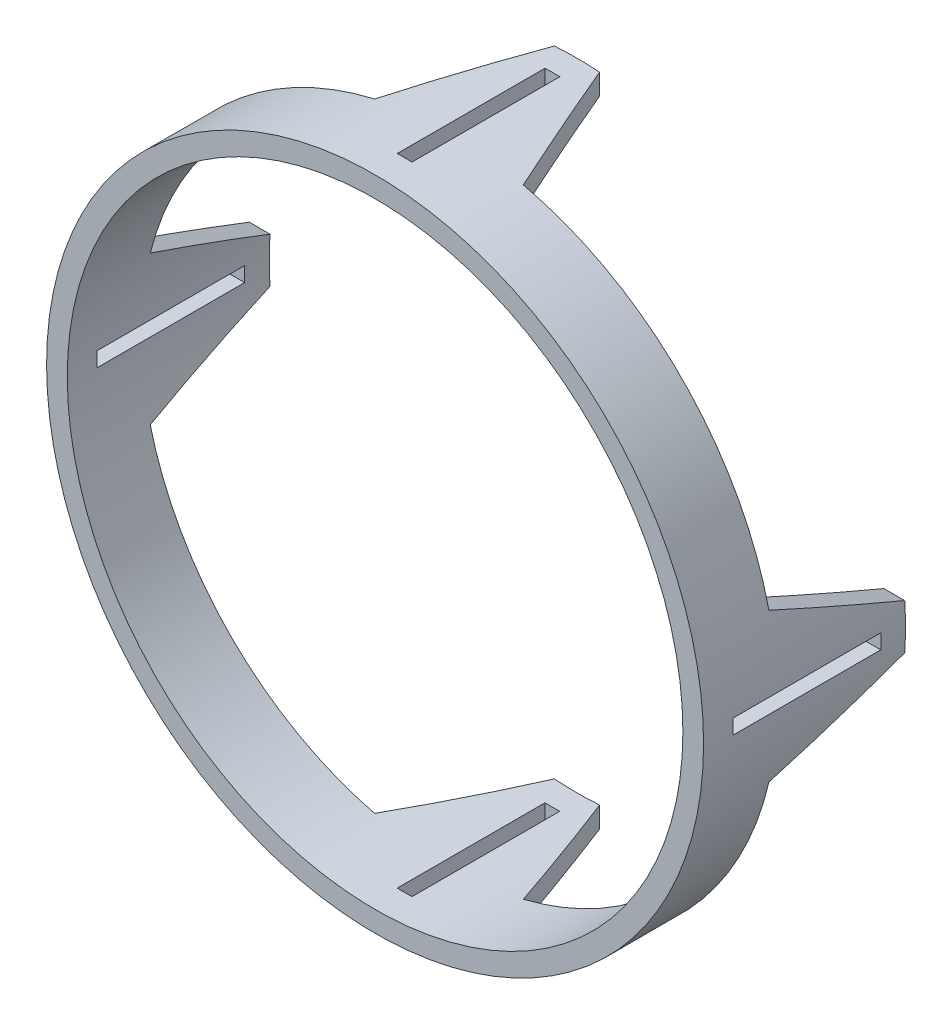
ISO-10303-21;
HEADER;
FILE_DESCRIPTION(('STEP AP214'),'2;1');
FILE_NAME('part.step','',(''),(''),'','','');
FILE_SCHEMA(('AUTOMOTIVE_DESIGN { 1 0 10303 214 1 1 1 1 }'));
ENDSEC;
DATA;
#1=APPLICATION_CONTEXT('core data for automotive mechanical design processes');
#2=APPLICATION_PROTOCOL_DEFINITION('international standard','automotive_design',2000,#1);
#3=PRODUCT_CONTEXT('',#1,'mechanical');
#4=PRODUCT('Part','Part','',(#3));
#5=PRODUCT_RELATED_PRODUCT_CATEGORY('part','',(#4));
#6=PRODUCT_DEFINITION_FORMATION('','',#4);
#7=PRODUCT_DEFINITION_CONTEXT('part definition',#1,'design');
#8=PRODUCT_DEFINITION('design','',#6,#7);
#9=PRODUCT_DEFINITION_SHAPE('','',#8);
#10=(LENGTH_UNIT() NAMED_UNIT(*) SI_UNIT(.MILLI.,.METRE.));
#11=(NAMED_UNIT(*) PLANE_ANGLE_UNIT() SI_UNIT($,.RADIAN.));
#12=(NAMED_UNIT(*) SI_UNIT($,.STERADIAN.) SOLID_ANGLE_UNIT());
#13=UNCERTAINTY_MEASURE_WITH_UNIT(LENGTH_MEASURE(1.E-05),#10,'distance_accuracy_value','');
#14=(GEOMETRIC_REPRESENTATION_CONTEXT(3) GLOBAL_UNCERTAINTY_ASSIGNED_CONTEXT((#13)) GLOBAL_UNIT_ASSIGNED_CONTEXT((#10,
#11,#12)) REPRESENTATION_CONTEXT('',''));
#15=CARTESIAN_POINT('',(0.,0.,0.));
#16=DIRECTION('',(0.,0.,1.));
#17=DIRECTION('',(1.,0.,0.));
#18=AXIS2_PLACEMENT_3D('',#15,#16,#17);
#19=CARTESIAN_POINT('',(0.,0.,0.));
#20=DIRECTION('',(0.,0.,1.));
#21=DIRECTION('',(1.,0.,0.));
#22=AXIS2_PLACEMENT_3D('',#19,#20,#21);
#23=PLANE('',#22);
#24=CARTESIAN_POINT('',(0.,0.,0.));
#25=DIRECTION('',(0.,0.,1.));
#26=DIRECTION('',(1.,0.,0.));
#27=AXIS2_PLACEMENT_3D('',#24,#25,#26);
#28=CIRCLE('',#27,79.375);
#29=CARTESIAN_POINT('',(77.0235892178491,19.1770000000011,0.));
#30=VERTEX_POINT('',#29);
#31=CARTESIAN_POINT('',(19.1770000000002,77.0235892178493,0.));
#32=VERTEX_POINT('',#31);
#33=EDGE_CURVE('E460',#30,#32,#28,.T.);
#34=ORIENTED_EDGE('',*,*,#33,.T.);
#35=DIRECTION('',(0.,1.,0.));
#36=VECTOR('',#35,1.);
#37=CARTESIAN_POINT('',(19.1770000000002,84.5159952671682,0.));
#38=LINE('',#37,#36);
#39=CARTESIAN_POINT('',(19.1770000000002,82.5097409522051,0.));
#40=VERTEX_POINT('',#39);
#41=EDGE_CURVE('E346',#32,#40,#38,.T.);
#42=ORIENTED_EDGE('',*,*,#41,.T.);
#43=CARTESIAN_POINT('',(0.,0.,0.));
#44=DIRECTION('',(0.,0.,1.));
#45=DIRECTION('',(1.,0.,0.));
#46=AXIS2_PLACEMENT_3D('',#43,#44,#45);
#47=CIRCLE('',#46,84.709);
#48=CARTESIAN_POINT('',(82.5097409522049,19.1770000000011,0.));
#49=VERTEX_POINT('',#48);
#50=EDGE_CURVE('E444',#49,#40,#47,.T.);
#51=ORIENTED_EDGE('',*,*,#50,.F.);
#52=DIRECTION('',(-1.,0.,0.));
#53=VECTOR('',#52,1.);
#54=CARTESIAN_POINT('',(79.1689926675839,19.1770000000011,0.));
#55=LINE('',#54,#53);
#56=EDGE_CURVE('E342',#49,#30,#55,.T.);
#57=ORIENTED_EDGE('',*,*,#56,.T.);
#58=EDGE_LOOP('',(#34,#42,#51,#57));
#59=FACE_BOUND('',#58,.T.);
#60=ADVANCED_FACE('F41',(#59),#23,.F.);
#61=CARTESIAN_POINT('',(19.1770000000002,-82.5097409522051,0.));
#62=VERTEX_POINT('',#61);
#63=CARTESIAN_POINT('',(82.5097409522053,-19.1769999999993,0.));
#64=VERTEX_POINT('',#63);
#65=EDGE_CURVE('E453',#62,#64,#47,.T.);
#66=ORIENTED_EDGE('',*,*,#65,.F.);
#67=DIRECTION('',(0.,1.,0.));
#68=VECTOR('',#67,1.);
#69=CARTESIAN_POINT('',(19.1770000000002,-79.1689926675842,0.));
#70=LINE('',#69,#68);
#71=CARTESIAN_POINT('',(19.1770000000002,-77.0235892178493,0.));
#72=VERTEX_POINT('',#71);
#73=EDGE_CURVE('E362',#62,#72,#70,.T.);
#74=ORIENTED_EDGE('',*,*,#73,.T.);
#75=CARTESIAN_POINT('',(77.0235892178495,-19.1769999999994,0.));
#76=VERTEX_POINT('',#75);
#77=EDGE_CURVE('E463',#72,#76,#28,.T.);
#78=ORIENTED_EDGE('',*,*,#77,.T.);
#79=DIRECTION('',(1.,0.,0.));
#80=VECTOR('',#79,1.);
#81=CARTESIAN_POINT('',(84.5159952671685,-19.1769999999993,0.));
#82=LINE('',#81,#80);
#83=EDGE_CURVE('E358',#76,#64,#82,.T.);
#84=ORIENTED_EDGE('',*,*,#83,.T.);
#85=EDGE_LOOP('',(#66,#74,#78,#84));
#86=FACE_BOUND('',#85,.T.);
#87=ADVANCED_FACE('F591',(#86),#23,.F.);
#88=CARTESIAN_POINT('',(-77.0235892178495,-19.1769999999994,0.));
#89=VERTEX_POINT('',#88);
#90=CARTESIAN_POINT('',(-19.1770000000003,-77.0235892178493,0.));
#91=VERTEX_POINT('',#90);
#92=EDGE_CURVE('E467',#89,#91,#28,.T.);
#93=ORIENTED_EDGE('',*,*,#92,.T.);
#94=DIRECTION('',(0.,-1.,0.));
#95=VECTOR('',#94,1.);
#96=CARTESIAN_POINT('',(-19.1770000000003,-84.5159952671682,0.));
#97=LINE('',#96,#95);
#98=CARTESIAN_POINT('',(-19.1770000000003,-82.5097409522051,0.));
#99=VERTEX_POINT('',#98);
#100=EDGE_CURVE('E354',#91,#99,#97,.T.);
#101=ORIENTED_EDGE('',*,*,#100,.T.);
#102=CARTESIAN_POINT('',(-82.5097409522053,-19.1769999999993,0.));
#103=VERTEX_POINT('',#102);
#104=EDGE_CURVE('E457',#103,#99,#47,.T.);
#105=ORIENTED_EDGE('',*,*,#104,.F.);
#106=DIRECTION('',(1.,0.,0.));
#107=VECTOR('',#106,1.);
#108=CARTESIAN_POINT('',(-79.1689926675844,-19.1769999999994,0.));
#109=LINE('',#108,#107);
#110=EDGE_CURVE('E350',#103,#89,#109,.T.);
#111=ORIENTED_EDGE('',*,*,#110,.T.);
#112=EDGE_LOOP('',(#93,#101,#105,#111));
#113=FACE_BOUND('',#112,.T.);
#114=ADVANCED_FACE('F482',(#113),#23,.F.);
#115=CARTESIAN_POINT('',(-19.1770000000002,77.0235892178493,0.));
#116=VERTEX_POINT('',#115);
#117=CARTESIAN_POINT('',(-77.0235892178491,19.1770000000011,0.));
#118=VERTEX_POINT('',#117);
#119=EDGE_CURVE('E466',#116,#118,#28,.T.);
#120=ORIENTED_EDGE('',*,*,#119,.T.);
#121=DIRECTION('',(-1.,0.,0.));
#122=VECTOR('',#121,1.);
#123=CARTESIAN_POINT('',(-84.515995267168,19.1770000000012,0.));
#124=LINE('',#123,#122);
#125=CARTESIAN_POINT('',(-82.5097409522049,19.1770000000011,0.));
#126=VERTEX_POINT('',#125);
#127=EDGE_CURVE('E338',#118,#126,#124,.T.);
#128=ORIENTED_EDGE('',*,*,#127,.T.);
#129=CARTESIAN_POINT('',(-19.1770000000002,82.5097409522051,0.));
#130=VERTEX_POINT('',#129);
#131=EDGE_CURVE('E456',#130,#126,#47,.T.);
#132=ORIENTED_EDGE('',*,*,#131,.F.);
#133=DIRECTION('',(0.,-1.,0.));
#134=VECTOR('',#133,1.);
#135=CARTESIAN_POINT('',(-19.1770000000002,79.1689926675842,0.));
#136=LINE('',#135,#134);
#137=EDGE_CURVE('E334',#130,#116,#136,.T.);
#138=ORIENTED_EDGE('',*,*,#137,.T.);
#139=EDGE_LOOP('',(#120,#128,#132,#138));
#140=FACE_BOUND('',#139,.T.);
#141=ADVANCED_FACE('F577',(#140),#23,.F.);
#142=CARTESIAN_POINT('',(0.,0.,19.05));
#143=DIRECTION('',(0.,0.,1.));
#144=DIRECTION('',(1.,0.,0.));
#145=AXIS2_PLACEMENT_3D('',#142,#143,#144);
#146=PLANE('',#145);
#147=CARTESIAN_POINT('',(0.,0.,19.05));
#148=DIRECTION('',(0.,0.,1.));
#149=DIRECTION('',(1.,0.,0.));
#150=AXIS2_PLACEMENT_3D('',#147,#148,#149);
#151=CIRCLE('',#150,84.709);
#152=CARTESIAN_POINT('',(84.709,0.,19.05));
#153=VERTEX_POINT('',#152);
#154=EDGE_CURVE('E496',#153,#153,#151,.T.);
#155=ORIENTED_EDGE('',*,*,#154,.T.);
#156=EDGE_LOOP('',(#155));
#157=FACE_BOUND('',#156,.T.);
#158=CARTESIAN_POINT('',(0.,0.,19.05));
#159=DIRECTION('',(0.,0.,1.));
#160=DIRECTION('',(1.,0.,0.));
#161=AXIS2_PLACEMENT_3D('',#158,#159,#160);
#162=CIRCLE('',#161,79.375);
#163=CARTESIAN_POINT('',(79.375,0.,19.05));
#164=VERTEX_POINT('',#163);
#165=EDGE_CURVE('E454',#164,#164,#162,.T.);
#166=ORIENTED_EDGE('',*,*,#165,.F.);
#167=EDGE_LOOP('',(#166));
#168=FACE_BOUND('',#167,.T.);
#169=ADVANCED_FACE('F575',(#157,#168),#146,.T.);
#170=CARTESIAN_POINT('',(0.,0.,19.05));
#171=DIRECTION('',(0.,0.,-1.));
#172=DIRECTION('',(-1.,0.,0.));
#173=AXIS2_PLACEMENT_3D('',#170,#171,#172);
#174=CYLINDRICAL_SURFACE('',#173,84.709);
#175=DIRECTION('',(0.,0.,-1.));
#176=VECTOR('',#175,1.);
#177=CARTESIAN_POINT('',(84.6875767512567,1.90500000000029,19.05));
#178=LINE('',#177,#176);
#179=CARTESIAN_POINT('',(84.6875767512567,1.90500000000029,11.43));
#180=VERTEX_POINT('',#179);
#181=CARTESIAN_POINT('',(84.6875767512567,1.90500000000029,-26.67));
#182=VERTEX_POINT('',#181);
#183=EDGE_CURVE('E542',#180,#182,#178,.T.);
#184=ORIENTED_EDGE('',*,*,#183,.T.);
#185=CARTESIAN_POINT('',(0.,0.,-26.67));
#186=DIRECTION('',(0.,0.,-1.));
#187=DIRECTION('',(-1.,0.,0.));
#188=AXIS2_PLACEMENT_3D('',#185,#186,#187);
#189=CIRCLE('',#188,84.709);
#190=CARTESIAN_POINT('',(84.6875767512567,-1.90499999999971,-26.67));
#191=VERTEX_POINT('',#190);
#192=EDGE_CURVE('E724',#182,#191,#189,.T.);
#193=ORIENTED_EDGE('',*,*,#192,.T.);
#194=DIRECTION('',(0.,0.,-1.));
#195=VECTOR('',#194,1.);
#196=CARTESIAN_POINT('',(84.6875767512567,-1.90499999999971,19.05));
#197=LINE('',#196,#195);
#198=CARTESIAN_POINT('',(84.6875767512567,-1.90499999999971,11.43));
#199=VERTEX_POINT('',#198);
#200=EDGE_CURVE('E725',#191,#199,#197,.F.);
#201=ORIENTED_EDGE('',*,*,#200,.T.);
#202=CARTESIAN_POINT('',(0.,0.,11.43));
#203=DIRECTION('',(0.,0.,1.));
#204=DIRECTION('',(1.,0.,0.));
#205=AXIS2_PLACEMENT_3D('',#202,#203,#204);
#206=CIRCLE('',#205,84.709);
#207=EDGE_CURVE('E733',#199,#180,#206,.T.);
#208=ORIENTED_EDGE('',*,*,#207,.T.);
#209=EDGE_LOOP('',(#184,#193,#201,#208));
#210=FACE_BOUND('',#209,.T.);
#211=DIRECTION('',(0.,0.,-1.));
#212=VECTOR('',#211,1.);
#213=CARTESIAN_POINT('',(1.905,84.6875767512567,19.05));
#214=LINE('',#213,#212);
#215=CARTESIAN_POINT('',(1.905,84.6875767512567,-26.67));
#216=VERTEX_POINT('',#215);
#217=CARTESIAN_POINT('',(1.905,84.6875767512567,11.43));
#218=VERTEX_POINT('',#217);
#219=EDGE_CURVE('E714',#216,#218,#214,.F.);
#220=ORIENTED_EDGE('',*,*,#219,.T.);
#221=CARTESIAN_POINT('',(-1.905,84.6875767512567,11.43));
#222=VERTEX_POINT('',#221);
#223=EDGE_CURVE('E736',#218,#222,#206,.T.);
#224=ORIENTED_EDGE('',*,*,#223,.T.);
#225=DIRECTION('',(0.,0.,-1.));
#226=VECTOR('',#225,1.);
#227=CARTESIAN_POINT('',(-1.905,84.6875767512567,19.05));
#228=LINE('',#227,#226);
#229=CARTESIAN_POINT('',(-1.905,84.6875767512567,-26.67));
#230=VERTEX_POINT('',#229);
#231=EDGE_CURVE('E718',#222,#230,#228,.T.);
#232=ORIENTED_EDGE('',*,*,#231,.T.);
#233=EDGE_CURVE('E686',#230,#216,#189,.T.);
#234=ORIENTED_EDGE('',*,*,#233,.T.);
#235=EDGE_LOOP('',(#220,#224,#232,#234));
#236=FACE_BOUND('',#235,.T.);
#237=CARTESIAN_POINT('',(-84.6875767512567,-1.9050000000003,-26.67));
#238=VERTEX_POINT('',#237);
#239=CARTESIAN_POINT('',(-84.6875767512567,1.90499999999911,-26.67));
#240=VERTEX_POINT('',#239);
#241=EDGE_CURVE('E721',#238,#240,#189,.T.);
#242=ORIENTED_EDGE('',*,*,#241,.T.);
#243=DIRECTION('',(0.,0.,-1.));
#244=VECTOR('',#243,1.);
#245=CARTESIAN_POINT('',(-84.6875767512567,1.90499999999911,19.05));
#246=LINE('',#245,#244);
#247=CARTESIAN_POINT('',(-84.6875767512567,1.90499999999911,11.43));
#248=VERTEX_POINT('',#247);
#249=EDGE_CURVE('E699',#240,#248,#246,.F.);
#250=ORIENTED_EDGE('',*,*,#249,.T.);
#251=CARTESIAN_POINT('',(-84.6875767512567,-1.9050000000003,11.43));
#252=VERTEX_POINT('',#251);
#253=EDGE_CURVE('E278',#248,#252,#206,.T.);
#254=ORIENTED_EDGE('',*,*,#253,.T.);
#255=DIRECTION('',(0.,0.,-1.));
#256=VECTOR('',#255,1.);
#257=CARTESIAN_POINT('',(-84.6875767512567,-1.9050000000003,19.05));
#258=LINE('',#257,#256);
#259=EDGE_CURVE('E729',#252,#238,#258,.T.);
#260=ORIENTED_EDGE('',*,*,#259,.T.);
#261=EDGE_LOOP('',(#242,#250,#254,#260));
#262=FACE_BOUND('',#261,.T.);
#263=DIRECTION('',(0.,0.,-1.));
#264=VECTOR('',#263,1.);
#265=CARTESIAN_POINT('',(1.905,-84.6875767512567,19.05));
#266=LINE('',#265,#264);
#267=CARTESIAN_POINT('',(1.905,-84.6875767512567,11.43));
#268=VERTEX_POINT('',#267);
#269=CARTESIAN_POINT('',(1.905,-84.6875767512567,-26.67));
#270=VERTEX_POINT('',#269);
#271=EDGE_CURVE('E554',#268,#270,#266,.T.);
#272=ORIENTED_EDGE('',*,*,#271,.T.);
#273=CARTESIAN_POINT('',(0.,0.,-26.67));
#274=DIRECTION('',(0.,0.,-1.));
#275=DIRECTION('',(-1.,0.,0.));
#276=AXIS2_PLACEMENT_3D('',#273,#274,#275);
#277=CIRCLE('',#276,84.709);
#278=CARTESIAN_POINT('',(-1.905,-84.6875767512567,-26.67));
#279=VERTEX_POINT('',#278);
#280=EDGE_CURVE('E546',#270,#279,#277,.T.);
#281=ORIENTED_EDGE('',*,*,#280,.T.);
#282=DIRECTION('',(0.,0.,-1.));
#283=VECTOR('',#282,1.);
#284=CARTESIAN_POINT('',(-1.905,-84.6875767512567,19.05));
#285=LINE('',#284,#283);
#286=CARTESIAN_POINT('',(-1.905,-84.6875767512567,11.43));
#287=VERTEX_POINT('',#286);
#288=EDGE_CURVE('E535',#279,#287,#285,.F.);
#289=ORIENTED_EDGE('',*,*,#288,.T.);
#290=CARTESIAN_POINT('',(0.,0.,11.43));
#291=DIRECTION('',(0.,0.,1.));
#292=DIRECTION('',(1.,0.,0.));
#293=AXIS2_PLACEMENT_3D('',#290,#291,#292);
#294=CIRCLE('',#293,84.709);
#295=EDGE_CURVE('E551',#287,#268,#294,.T.);
#296=ORIENTED_EDGE('',*,*,#295,.T.);
#297=EDGE_LOOP('',(#272,#281,#289,#296));
#298=FACE_BOUND('',#297,.T.);
#299=ORIENTED_EDGE('',*,*,#154,.F.);
#300=EDGE_LOOP('',(#299));
#301=FACE_BOUND('',#300,.T.);
#302=CARTESIAN_POINT('',(0.,0.,-33.02));
#303=DIRECTION('',(0.,0.,-1.));
#304=DIRECTION('',(-1.,0.,0.));
#305=AXIS2_PLACEMENT_3D('',#302,#303,#304);
#306=CIRCLE('',#305,84.709);
#307=CARTESIAN_POINT('',(-5.83605402292349,84.5077224544687,-33.02));
#308=VERTEX_POINT('',#307);
#309=CARTESIAN_POINT('',(5.83605402292349,84.5077224544687,-33.02));
#310=VERTEX_POINT('',#309);
#311=EDGE_CURVE('E464',#308,#310,#306,.T.);
#312=ORIENTED_EDGE('',*,*,#311,.F.);
#313=CARTESIAN_POINT('',(0.,0.,-47.4647405879654));
#314=DIRECTION('',(-0.927183854566789,0.,-0.374606593415909));
#315=DIRECTION('',(0.374606593415909,0.,-0.927183854566789));
#316=AXIS2_PLACEMENT_3D('',#313,#314,#315);
#317=ELLIPSE('',#316,226.12789387279,84.709);
#318=EDGE_CURVE('E379',#308,#130,#317,.F.);
#319=ORIENTED_EDGE('',*,*,#318,.T.);
#320=ORIENTED_EDGE('',*,*,#131,.T.);
#321=CARTESIAN_POINT('',(0.,0.,-47.4647405879649));
#322=DIRECTION('',(0.,0.927183854566789,-0.374606593415909));
#323=DIRECTION('',(0.,-0.374606593415909,-0.927183854566789));
#324=AXIS2_PLACEMENT_3D('',#321,#322,#323);
#325=ELLIPSE('',#324,226.12789387279,84.709);
#326=CARTESIAN_POINT('',(-84.5077224544686,5.83605402292442,-33.02));
#327=VERTEX_POINT('',#326);
#328=EDGE_CURVE('E372',#126,#327,#325,.F.);
#329=ORIENTED_EDGE('',*,*,#328,.T.);
#330=CARTESIAN_POINT('',(0.,0.,-33.02));
#331=DIRECTION('',(0.,0.,-1.));
#332=DIRECTION('',(-1.,0.,0.));
#333=AXIS2_PLACEMENT_3D('',#330,#331,#332);
#334=CIRCLE('',#333,84.709);
#335=CARTESIAN_POINT('',(-84.5077224544688,-5.83605402292257,-33.02));
#336=VERTEX_POINT('',#335);
#337=EDGE_CURVE('E103',#336,#327,#334,.T.);
#338=ORIENTED_EDGE('',*,*,#337,.F.);
#339=CARTESIAN_POINT('',(0.,0.,-47.4647405879664));
#340=DIRECTION('',(0.,-0.927183854566789,-0.374606593415909));
#341=DIRECTION('',(0.,0.374606593415909,-0.927183854566789));
#342=AXIS2_PLACEMENT_3D('',#339,#340,#341);
#343=ELLIPSE('',#342,226.12789387279,84.709);
#344=EDGE_CURVE('E422',#336,#103,#343,.F.);
#345=ORIENTED_EDGE('',*,*,#344,.T.);
#346=ORIENTED_EDGE('',*,*,#104,.T.);
#347=CARTESIAN_POINT('',(0.,0.,-47.4647405879654));
#348=DIRECTION('',(-0.927183854566789,0.,-0.374606593415909));
#349=DIRECTION('',(0.374606593415909,0.,-0.927183854566789));
#350=AXIS2_PLACEMENT_3D('',#347,#348,#349);
#351=ELLIPSE('',#350,226.12789387279,84.709);
#352=CARTESIAN_POINT('',(-5.83605402292351,-84.5077224544687,-33.02));
#353=VERTEX_POINT('',#352);
#354=EDGE_CURVE('E404',#99,#353,#351,.F.);
#355=ORIENTED_EDGE('',*,*,#354,.T.);
#356=CARTESIAN_POINT('',(0.,0.,-33.02));
#357=DIRECTION('',(0.,0.,-1.));
#358=DIRECTION('',(1.,0.,0.));
#359=AXIS2_PLACEMENT_3D('',#356,#357,#358);
#360=CIRCLE('',#359,84.709);
#361=CARTESIAN_POINT('',(5.83605402292347,-84.5077224544687,-33.02));
#362=VERTEX_POINT('',#361);
#363=EDGE_CURVE('E490',#362,#353,#360,.T.);
#364=ORIENTED_EDGE('',*,*,#363,.F.);
#365=CARTESIAN_POINT('',(0.,0.,-47.4647405879654));
#366=DIRECTION('',(0.927183854566789,0.,-0.374606593415909));
#367=DIRECTION('',(-0.374606593415909,0.,-0.927183854566789));
#368=AXIS2_PLACEMENT_3D('',#365,#366,#367);
#369=ELLIPSE('',#368,226.12789387279,84.709);
#370=EDGE_CURVE('E412',#362,#62,#369,.F.);
#371=ORIENTED_EDGE('',*,*,#370,.T.);
#372=ORIENTED_EDGE('',*,*,#65,.T.);
#373=CARTESIAN_POINT('',(0.,0.,-47.4647405879664));
#374=DIRECTION('',(0.,-0.927183854566789,-0.374606593415909));
#375=DIRECTION('',(0.,0.374606593415909,-0.927183854566789));
#376=AXIS2_PLACEMENT_3D('',#373,#374,#375);
#377=ELLIPSE('',#376,226.12789387279,84.709);
#378=CARTESIAN_POINT('',(84.5077224544688,-5.83605402292257,-33.02));
#379=VERTEX_POINT('',#378);
#380=EDGE_CURVE('E434',#64,#379,#377,.F.);
#381=ORIENTED_EDGE('',*,*,#380,.T.);
#382=CARTESIAN_POINT('',(0.,0.,-33.02));
#383=DIRECTION('',(0.,0.,-1.));
#384=DIRECTION('',(1.,0.,0.));
#385=AXIS2_PLACEMENT_3D('',#382,#383,#384);
#386=CIRCLE('',#385,84.709);
#387=CARTESIAN_POINT('',(84.5077224544686,5.83605402292442,-33.02));
#388=VERTEX_POINT('',#387);
#389=EDGE_CURVE('E66',#388,#379,#386,.T.);
#390=ORIENTED_EDGE('',*,*,#389,.F.);
#391=CARTESIAN_POINT('',(0.,0.,-47.4647405879649));
#392=DIRECTION('',(0.,0.927183854566789,-0.374606593415909));
#393=DIRECTION('',(0.,-0.374606593415909,-0.927183854566789));
#394=AXIS2_PLACEMENT_3D('',#391,#392,#393);
#395=ELLIPSE('',#394,226.12789387279,84.709);
#396=EDGE_CURVE('E51',#388,#49,#395,.F.);
#397=ORIENTED_EDGE('',*,*,#396,.T.);
#398=ORIENTED_EDGE('',*,*,#50,.T.);
#399=CARTESIAN_POINT('',(0.,0.,-47.4647405879654));
#400=DIRECTION('',(0.927183854566789,0.,-0.374606593415909));
#401=DIRECTION('',(-0.374606593415909,0.,-0.927183854566789));
#402=AXIS2_PLACEMENT_3D('',#399,#400,#401);
#403=ELLIPSE('',#402,226.12789387279,84.709);
#404=EDGE_CURVE('E393',#40,#310,#403,.F.);
#405=ORIENTED_EDGE('',*,*,#404,.T.);
#406=EDGE_LOOP('',(#312,#319,#320,#329,#338,#345,#346,#355,#364,#371,#372,#381,#390,#397,#398,#405));
#407=FACE_BOUND('',#406,.T.);
#408=ADVANCED_FACE('F443',(#210,#236,#262,#298,#301,#407),#174,.T.);
#409=CARTESIAN_POINT('',(0.,0.,19.05));
#410=DIRECTION('',(0.,0.,-1.));
#411=DIRECTION('',(-1.,0.,0.));
#412=AXIS2_PLACEMENT_3D('',#409,#410,#411);
#413=CYLINDRICAL_SURFACE('',#412,79.375);
#414=DIRECTION('',(0.,0.,-1.));
#415=VECTOR('',#414,1.);
#416=CARTESIAN_POINT('',(79.3521367072116,1.90500000000028,19.05));
#417=LINE('',#416,#415);
#418=CARTESIAN_POINT('',(79.3521367072116,1.90500000000028,11.43));
#419=VERTEX_POINT('',#418);
#420=CARTESIAN_POINT('',(79.3521367072116,1.90500000000028,-26.67));
#421=VERTEX_POINT('',#420);
#422=EDGE_CURVE('E298',#419,#421,#417,.T.);
#423=ORIENTED_EDGE('',*,*,#422,.F.);
#424=CARTESIAN_POINT('',(0.,0.,11.43));
#425=DIRECTION('',(0.,0.,1.));
#426=DIRECTION('',(1.,0.,0.));
#427=AXIS2_PLACEMENT_3D('',#424,#425,#426);
#428=CIRCLE('',#427,79.375);
#429=CARTESIAN_POINT('',(79.3521367072116,-1.90499999999972,11.43));
#430=VERTEX_POINT('',#429);
#431=EDGE_CURVE('E290',#430,#419,#428,.T.);
#432=ORIENTED_EDGE('',*,*,#431,.F.);
#433=DIRECTION('',(0.,0.,-1.));
#434=VECTOR('',#433,1.);
#435=CARTESIAN_POINT('',(79.3521367072116,-1.90499999999972,19.05));
#436=LINE('',#435,#434);
#437=CARTESIAN_POINT('',(79.3521367072116,-1.90499999999972,-26.67));
#438=VERTEX_POINT('',#437);
#439=EDGE_CURVE('E299',#438,#430,#436,.F.);
#440=ORIENTED_EDGE('',*,*,#439,.F.);
#441=CARTESIAN_POINT('',(0.,0.,-26.67));
#442=DIRECTION('',(0.,0.,-1.));
#443=DIRECTION('',(-1.,0.,0.));
#444=AXIS2_PLACEMENT_3D('',#441,#442,#443);
#445=CIRCLE('',#444,79.375);
#446=EDGE_CURVE('E309',#421,#438,#445,.T.);
#447=ORIENTED_EDGE('',*,*,#446,.F.);
#448=EDGE_LOOP('',(#423,#432,#440,#447));
#449=FACE_BOUND('',#448,.T.);
#450=DIRECTION('',(0.,0.,-1.));
#451=VECTOR('',#450,1.);
#452=CARTESIAN_POINT('',(-1.905,79.3521367072116,19.05));
#453=LINE('',#452,#451);
#454=CARTESIAN_POINT('',(-1.905,79.3521367072116,11.43));
#455=VERTEX_POINT('',#454);
#456=CARTESIAN_POINT('',(-1.905,79.3521367072116,-26.67));
#457=VERTEX_POINT('',#456);
#458=EDGE_CURVE('E301',#455,#457,#453,.T.);
#459=ORIENTED_EDGE('',*,*,#458,.F.);
#460=CARTESIAN_POINT('',(1.905,79.3521367072116,11.43));
#461=VERTEX_POINT('',#460);
#462=EDGE_CURVE('E291',#461,#455,#428,.T.);
#463=ORIENTED_EDGE('',*,*,#462,.F.);
#464=DIRECTION('',(0.,0.,-1.));
#465=VECTOR('',#464,1.);
#466=CARTESIAN_POINT('',(1.905,79.3521367072116,19.05));
#467=LINE('',#466,#465);
#468=CARTESIAN_POINT('',(1.905,79.3521367072116,-26.67));
#469=VERTEX_POINT('',#468);
#470=EDGE_CURVE('E288',#469,#461,#467,.F.);
#471=ORIENTED_EDGE('',*,*,#470,.F.);
#472=EDGE_CURVE('E294',#457,#469,#445,.T.);
#473=ORIENTED_EDGE('',*,*,#472,.F.);
#474=EDGE_LOOP('',(#459,#463,#471,#473));
#475=FACE_BOUND('',#474,.T.);
#476=CARTESIAN_POINT('',(-79.3521367072116,1.90499999999917,11.43));
#477=VERTEX_POINT('',#476);
#478=CARTESIAN_POINT('',(-79.3521367072116,-1.90500000000028,11.43));
#479=VERTEX_POINT('',#478);
#480=EDGE_CURVE('E276',#477,#479,#428,.T.);
#481=ORIENTED_EDGE('',*,*,#480,.F.);
#482=DIRECTION('',(0.,0.,-1.));
#483=VECTOR('',#482,1.);
#484=CARTESIAN_POINT('',(-79.3521367072116,1.90499999999917,19.05));
#485=LINE('',#484,#483);
#486=CARTESIAN_POINT('',(-79.3521367072116,1.90499999999917,-26.67));
#487=VERTEX_POINT('',#486);
#488=EDGE_CURVE('E257',#487,#477,#485,.F.);
#489=ORIENTED_EDGE('',*,*,#488,.F.);
#490=CARTESIAN_POINT('',(-79.3521367072116,-1.90500000000028,-26.67));
#491=VERTEX_POINT('',#490);
#492=EDGE_CURVE('E270',#491,#487,#445,.T.);
#493=ORIENTED_EDGE('',*,*,#492,.F.);
#494=DIRECTION('',(0.,0.,-1.));
#495=VECTOR('',#494,1.);
#496=CARTESIAN_POINT('',(-79.3521367072116,-1.90500000000028,19.05));
#497=LINE('',#496,#495);
#498=EDGE_CURVE('E286',#479,#491,#497,.T.);
#499=ORIENTED_EDGE('',*,*,#498,.F.);
#500=EDGE_LOOP('',(#481,#489,#493,#499));
#501=FACE_BOUND('',#500,.T.);
#502=DIRECTION('',(0.,0.,-1.));
#503=VECTOR('',#502,1.);
#504=CARTESIAN_POINT('',(1.905,-79.3521367072116,19.05));
#505=LINE('',#504,#503);
#506=CARTESIAN_POINT('',(1.905,-79.3521367072116,11.43));
#507=VERTEX_POINT('',#506);
#508=CARTESIAN_POINT('',(1.905,-79.3521367072116,-26.67));
#509=VERTEX_POINT('',#508);
#510=EDGE_CURVE('E271',#507,#509,#505,.T.);
#511=ORIENTED_EDGE('',*,*,#510,.F.);
#512=CARTESIAN_POINT('',(0.,0.,11.43));
#513=DIRECTION('',(0.,0.,1.));
#514=DIRECTION('',(1.,0.,0.));
#515=AXIS2_PLACEMENT_3D('',#512,#513,#514);
#516=CIRCLE('',#515,79.375);
#517=CARTESIAN_POINT('',(-1.905,-79.3521367072116,11.43));
#518=VERTEX_POINT('',#517);
#519=EDGE_CURVE('E505',#518,#507,#516,.T.);
#520=ORIENTED_EDGE('',*,*,#519,.F.);
#521=DIRECTION('',(0.,0.,-1.));
#522=VECTOR('',#521,1.);
#523=CARTESIAN_POINT('',(-1.905,-79.3521367072116,19.05));
#524=LINE('',#523,#522);
#525=CARTESIAN_POINT('',(-1.905,-79.3521367072116,-26.67));
#526=VERTEX_POINT('',#525);
#527=EDGE_CURVE('E502',#526,#518,#524,.F.);
#528=ORIENTED_EDGE('',*,*,#527,.F.);
#529=CARTESIAN_POINT('',(0.,0.,-26.67));
#530=DIRECTION('',(0.,0.,-1.));
#531=DIRECTION('',(-1.,0.,0.));
#532=AXIS2_PLACEMENT_3D('',#529,#530,#531);
#533=CIRCLE('',#532,79.375);
#534=EDGE_CURVE('E499',#509,#526,#533,.T.);
#535=ORIENTED_EDGE('',*,*,#534,.F.);
#536=EDGE_LOOP('',(#511,#520,#528,#535));
#537=FACE_BOUND('',#536,.T.);
#538=ORIENTED_EDGE('',*,*,#165,.T.);
#539=EDGE_LOOP('',(#538));
#540=FACE_BOUND('',#539,.T.);
#541=ORIENTED_EDGE('',*,*,#119,.F.);
#542=CARTESIAN_POINT('',(0.,0.,-47.4647405879654));
#543=DIRECTION('',(-0.927183854566789,0.,-0.374606593415909));
#544=DIRECTION('',(0.374606593415909,0.,-0.927183854566789));
#545=AXIS2_PLACEMENT_3D('',#542,#543,#544);
#546=ELLIPSE('',#545,211.888956027727,79.375);
#547=CARTESIAN_POINT('',(-5.83605402292349,79.1601610561873,-33.02));
#548=VERTEX_POINT('',#547);
#549=EDGE_CURVE('E382',#116,#548,#546,.T.);
#550=ORIENTED_EDGE('',*,*,#549,.T.);
#551=CARTESIAN_POINT('',(0.,0.,-33.02));
#552=DIRECTION('',(0.,0.,1.));
#553=DIRECTION('',(-1.,0.,0.));
#554=AXIS2_PLACEMENT_3D('',#551,#552,#553);
#555=CIRCLE('',#554,79.375);
#556=CARTESIAN_POINT('',(5.83605402292349,79.1601610561873,-33.02));
#557=VERTEX_POINT('',#556);
#558=EDGE_CURVE('E471',#557,#548,#555,.T.);
#559=ORIENTED_EDGE('',*,*,#558,.F.);
#560=CARTESIAN_POINT('',(0.,0.,-47.4647405879654));
#561=DIRECTION('',(0.927183854566789,0.,-0.374606593415909));
#562=DIRECTION('',(-0.374606593415909,0.,-0.927183854566789));
#563=AXIS2_PLACEMENT_3D('',#560,#561,#562);
#564=ELLIPSE('',#563,211.888956027727,79.375);
#565=EDGE_CURVE('E390',#557,#32,#564,.T.);
#566=ORIENTED_EDGE('',*,*,#565,.T.);
#567=ORIENTED_EDGE('',*,*,#33,.F.);
#568=CARTESIAN_POINT('',(0.,0.,-47.4647405879649));
#569=DIRECTION('',(0.,0.927183854566789,-0.374606593415909));
#570=DIRECTION('',(0.,-0.374606593415909,-0.927183854566789));
#571=AXIS2_PLACEMENT_3D('',#568,#569,#570);
#572=ELLIPSE('',#571,211.888956027727,79.375);
#573=CARTESIAN_POINT('',(79.1601610561873,5.83605402292435,-33.02));
#574=VERTEX_POINT('',#573);
#575=EDGE_CURVE('E11',#30,#574,#572,.T.);
#576=ORIENTED_EDGE('',*,*,#575,.T.);
#577=CARTESIAN_POINT('',(0.,0.,-33.02));
#578=DIRECTION('',(0.,0.,1.));
#579=DIRECTION('',(1.,0.,0.));
#580=AXIS2_PLACEMENT_3D('',#577,#578,#579);
#581=CIRCLE('',#580,79.375);
#582=CARTESIAN_POINT('',(79.1601610561874,-5.83605402292266,-33.02));
#583=VERTEX_POINT('',#582);
#584=EDGE_CURVE('E58',#583,#574,#581,.T.);
#585=ORIENTED_EDGE('',*,*,#584,.F.);
#586=CARTESIAN_POINT('',(0.,0.,-47.4647405879664));
#587=DIRECTION('',(0.,-0.927183854566789,-0.374606593415909));
#588=DIRECTION('',(0.,0.374606593415909,-0.927183854566789));
#589=AXIS2_PLACEMENT_3D('',#586,#587,#588);
#590=ELLIPSE('',#589,211.888956027727,79.375);
#591=EDGE_CURVE('E431',#583,#76,#590,.T.);
#592=ORIENTED_EDGE('',*,*,#591,.T.);
#593=ORIENTED_EDGE('',*,*,#77,.F.);
#594=CARTESIAN_POINT('',(0.,0.,-47.4647405879654));
#595=DIRECTION('',(0.927183854566789,0.,-0.374606593415909));
#596=DIRECTION('',(-0.374606593415909,0.,-0.927183854566789));
#597=AXIS2_PLACEMENT_3D('',#594,#595,#596);
#598=ELLIPSE('',#597,211.888956027727,79.375);
#599=CARTESIAN_POINT('',(5.83605402292347,-79.1601610561873,-33.02));
#600=VERTEX_POINT('',#599);
#601=EDGE_CURVE('E415',#72,#600,#598,.T.);
#602=ORIENTED_EDGE('',*,*,#601,.T.);
#603=CARTESIAN_POINT('',(0.,0.,-33.02));
#604=DIRECTION('',(0.,0.,1.));
#605=DIRECTION('',(1.,0.,0.));
#606=AXIS2_PLACEMENT_3D('',#603,#604,#605);
#607=CIRCLE('',#606,79.375);
#608=CARTESIAN_POINT('',(-5.83605402292351,-79.1601610561873,-33.02));
#609=VERTEX_POINT('',#608);
#610=EDGE_CURVE('E561',#609,#600,#607,.T.);
#611=ORIENTED_EDGE('',*,*,#610,.F.);
#612=CARTESIAN_POINT('',(0.,0.,-47.4647405879654));
#613=DIRECTION('',(-0.927183854566789,0.,-0.374606593415909));
#614=DIRECTION('',(0.374606593415909,0.,-0.927183854566789));
#615=AXIS2_PLACEMENT_3D('',#612,#613,#614);
#616=ELLIPSE('',#615,211.888956027727,79.375);
#617=EDGE_CURVE('E401',#609,#91,#616,.T.);
#618=ORIENTED_EDGE('',*,*,#617,.T.);
#619=ORIENTED_EDGE('',*,*,#92,.F.);
#620=CARTESIAN_POINT('',(0.,0.,-47.4647405879664));
#621=DIRECTION('',(0.,-0.927183854566789,-0.374606593415909));
#622=DIRECTION('',(0.,0.374606593415909,-0.927183854566789));
#623=AXIS2_PLACEMENT_3D('',#620,#621,#622);
#624=ELLIPSE('',#623,211.888956027727,79.375);
#625=CARTESIAN_POINT('',(-79.1601610561874,-5.83605402292266,-33.02));
#626=VERTEX_POINT('',#625);
#627=EDGE_CURVE('E425',#89,#626,#624,.T.);
#628=ORIENTED_EDGE('',*,*,#627,.T.);
#629=CARTESIAN_POINT('',(0.,0.,-33.02));
#630=DIRECTION('',(0.,0.,1.));
#631=DIRECTION('',(-1.,0.,0.));
#632=AXIS2_PLACEMENT_3D('',#629,#630,#631);
#633=CIRCLE('',#632,79.375);
#634=CARTESIAN_POINT('',(-79.1601610561872,5.83605402292435,-33.02));
#635=VERTEX_POINT('',#634);
#636=EDGE_CURVE('E98',#635,#626,#633,.T.);
#637=ORIENTED_EDGE('',*,*,#636,.F.);
#638=CARTESIAN_POINT('',(0.,0.,-47.4647405879649));
#639=DIRECTION('',(0.,0.927183854566789,-0.374606593415909));
#640=DIRECTION('',(0.,-0.374606593415909,-0.927183854566789));
#641=AXIS2_PLACEMENT_3D('',#638,#639,#640);
#642=ELLIPSE('',#641,211.888956027727,79.375);
#643=EDGE_CURVE('E369',#635,#118,#642,.T.);
#644=ORIENTED_EDGE('',*,*,#643,.T.);
#645=EDGE_LOOP('',(#541,#550,#559,#566,#567,#576,#585,#592,#593,#602,#611,#618,#619,#628,#637,#644));
#646=FACE_BOUND('',#645,.T.);
#647=ADVANCED_FACE('F284',(#449,#475,#501,#537,#540,#646),#413,.F.);
#648=CARTESIAN_POINT('',(0.,0.,-33.02));
#649=DIRECTION('',(0.,0.,-1.));
#650=DIRECTION('',(-1.,0.,0.));
#651=AXIS2_PLACEMENT_3D('',#648,#649,#650);
#652=PLANE('',#651);
#653=ORIENTED_EDGE('',*,*,#558,.T.);
#654=DIRECTION('',(0.,-1.,0.));
#655=VECTOR('',#654,1.);
#656=CARTESIAN_POINT('',(-5.83605402292349,79.1689926675842,-33.02));
#657=LINE('',#656,#655);
#658=EDGE_CURVE('E375',#548,#308,#657,.F.);
#659=ORIENTED_EDGE('',*,*,#658,.T.);
#660=ORIENTED_EDGE('',*,*,#311,.T.);
#661=DIRECTION('',(0.,1.,0.));
#662=VECTOR('',#661,1.);
#663=CARTESIAN_POINT('',(5.83605402292349,79.1689926675842,-33.02));
#664=LINE('',#663,#662);
#665=EDGE_CURVE('E386',#310,#557,#664,.F.);
#666=ORIENTED_EDGE('',*,*,#665,.T.);
#667=EDGE_LOOP('',(#653,#659,#660,#666));
#668=FACE_BOUND('',#667,.T.);
#669=ADVANCED_FACE('F665',(#668),#652,.T.);
#670=CARTESIAN_POINT('',(0.,0.,-33.02));
#671=DIRECTION('',(0.,0.,-1.));
#672=DIRECTION('',(-1.,0.,0.));
#673=AXIS2_PLACEMENT_3D('',#670,#671,#672);
#674=PLANE('',#673);
#675=ORIENTED_EDGE('',*,*,#636,.T.);
#676=DIRECTION('',(1.,0.,0.));
#677=VECTOR('',#676,1.);
#678=CARTESIAN_POINT('',(-79.1689926675842,-5.83605402292266,-33.02));
#679=LINE('',#678,#677);
#680=EDGE_CURVE('E419',#626,#336,#679,.F.);
#681=ORIENTED_EDGE('',*,*,#680,.T.);
#682=ORIENTED_EDGE('',*,*,#337,.T.);
#683=DIRECTION('',(-1.,0.,0.));
#684=VECTOR('',#683,1.);
#685=CARTESIAN_POINT('',(-79.1689926675841,5.83605402292435,-33.02));
#686=LINE('',#685,#684);
#687=EDGE_CURVE('E366',#327,#635,#686,.F.);
#688=ORIENTED_EDGE('',*,*,#687,.T.);
#689=EDGE_LOOP('',(#675,#681,#682,#688));
#690=FACE_BOUND('',#689,.T.);
#691=ADVANCED_FACE('F658',(#690),#674,.T.);
#692=CARTESIAN_POINT('',(0.,0.,-33.02));
#693=DIRECTION('',(0.,0.,1.));
#694=DIRECTION('',(1.,0.,0.));
#695=AXIS2_PLACEMENT_3D('',#692,#693,#694);
#696=PLANE('',#695);
#697=ORIENTED_EDGE('',*,*,#610,.T.);
#698=DIRECTION('',(0.,1.,0.));
#699=VECTOR('',#698,1.);
#700=CARTESIAN_POINT('',(5.8360540229235,0.,-33.02));
#701=LINE('',#700,#699);
#702=EDGE_CURVE('E408',#600,#362,#701,.F.);
#703=ORIENTED_EDGE('',*,*,#702,.T.);
#704=ORIENTED_EDGE('',*,*,#363,.T.);
#705=DIRECTION('',(0.,-1.,0.));
#706=VECTOR('',#705,1.);
#707=CARTESIAN_POINT('',(-5.83605402292348,0.,-33.02));
#708=LINE('',#707,#706);
#709=EDGE_CURVE('E397',#353,#609,#708,.F.);
#710=ORIENTED_EDGE('',*,*,#709,.T.);
#711=EDGE_LOOP('',(#697,#703,#704,#710));
#712=FACE_BOUND('',#711,.T.);
#713=ADVANCED_FACE('F655',(#712),#696,.F.);
#714=CARTESIAN_POINT('',(0.,0.,-33.02));
#715=DIRECTION('',(0.,0.,1.));
#716=DIRECTION('',(1.,0.,0.));
#717=AXIS2_PLACEMENT_3D('',#714,#715,#716);
#718=PLANE('',#717);
#719=ORIENTED_EDGE('',*,*,#584,.T.);
#720=DIRECTION('',(-1.,0.,0.));
#721=VECTOR('',#720,1.);
#722=CARTESIAN_POINT('',(0.,5.83605402292332,-33.02));
#723=LINE('',#722,#721);
#724=EDGE_CURVE('E437',#574,#388,#723,.F.);
#725=ORIENTED_EDGE('',*,*,#724,.T.);
#726=ORIENTED_EDGE('',*,*,#389,.T.);
#727=DIRECTION('',(1.,0.,0.));
#728=VECTOR('',#727,1.);
#729=CARTESIAN_POINT('',(0.,-5.83605402292389,-33.02));
#730=LINE('',#729,#728);
#731=EDGE_CURVE('E428',#379,#583,#730,.F.);
#732=ORIENTED_EDGE('',*,*,#731,.T.);
#733=EDGE_LOOP('',(#719,#725,#726,#732));
#734=FACE_BOUND('',#733,.T.);
#735=ADVANCED_FACE('F657',(#734),#718,.F.);
#736=CARTESIAN_POINT('',(1.905,-84.709,11.43));
#737=DIRECTION('',(1.,0.,0.));
#738=DIRECTION('',(0.,0.,-1.));
#739=AXIS2_PLACEMENT_3D('',#736,#737,#738);
#740=PLANE('',#739);
#741=DIRECTION('',(0.,1.,0.));
#742=VECTOR('',#741,1.);
#743=CARTESIAN_POINT('',(1.905,-84.709,11.43));
#744=LINE('',#743,#742);
#745=EDGE_CURVE('E520',#268,#507,#744,.T.);
#746=ORIENTED_EDGE('',*,*,#745,.T.);
#747=ORIENTED_EDGE('',*,*,#510,.T.);
#748=DIRECTION('',(0.,1.,0.));
#749=VECTOR('',#748,1.);
#750=CARTESIAN_POINT('',(1.905,-84.709,-26.67));
#751=LINE('',#750,#749);
#752=EDGE_CURVE('E517',#270,#509,#751,.T.);
#753=ORIENTED_EDGE('',*,*,#752,.F.);
#754=ORIENTED_EDGE('',*,*,#271,.F.);
#755=EDGE_LOOP('',(#746,#747,#753,#754));
#756=FACE_BOUND('',#755,.T.);
#757=ADVANCED_FACE('F515',(#756),#740,.F.);
#758=CARTESIAN_POINT('',(-1.905,-84.709,11.43));
#759=DIRECTION('',(0.,0.,1.));
#760=DIRECTION('',(1.,0.,0.));
#761=AXIS2_PLACEMENT_3D('',#758,#759,#760);
#762=PLANE('',#761);
#763=DIRECTION('',(0.,1.,0.));
#764=VECTOR('',#763,1.);
#765=CARTESIAN_POINT('',(-1.905,-84.709,11.43));
#766=LINE('',#765,#764);
#767=EDGE_CURVE('E537',#287,#518,#766,.T.);
#768=ORIENTED_EDGE('',*,*,#767,.T.);
#769=ORIENTED_EDGE('',*,*,#519,.T.);
#770=ORIENTED_EDGE('',*,*,#745,.F.);
#771=ORIENTED_EDGE('',*,*,#295,.F.);
#772=EDGE_LOOP('',(#768,#769,#770,#771));
#773=FACE_BOUND('',#772,.T.);
#774=ADVANCED_FACE('F784',(#773),#762,.F.);
#775=CARTESIAN_POINT('',(-1.905,-84.709,11.43));
#776=DIRECTION('',(-1.,0.,0.));
#777=DIRECTION('',(0.,0.,1.));
#778=AXIS2_PLACEMENT_3D('',#775,#776,#777);
#779=PLANE('',#778);
#780=DIRECTION('',(0.,1.,0.));
#781=VECTOR('',#780,1.);
#782=CARTESIAN_POINT('',(-1.905,-84.709,-26.67));
#783=LINE('',#782,#781);
#784=EDGE_CURVE('E528',#279,#526,#783,.T.);
#785=ORIENTED_EDGE('',*,*,#784,.T.);
#786=ORIENTED_EDGE('',*,*,#527,.T.);
#787=ORIENTED_EDGE('',*,*,#767,.F.);
#788=ORIENTED_EDGE('',*,*,#288,.F.);
#789=EDGE_LOOP('',(#785,#786,#787,#788));
#790=FACE_BOUND('',#789,.T.);
#791=ADVANCED_FACE('F531',(#790),#779,.F.);
#792=CARTESIAN_POINT('',(-1.905,-84.709,-26.67));
#793=DIRECTION('',(0.,0.,-1.));
#794=DIRECTION('',(-1.,0.,0.));
#795=AXIS2_PLACEMENT_3D('',#792,#793,#794);
#796=PLANE('',#795);
#797=ORIENTED_EDGE('',*,*,#752,.T.);
#798=ORIENTED_EDGE('',*,*,#534,.T.);
#799=ORIENTED_EDGE('',*,*,#784,.F.);
#800=ORIENTED_EDGE('',*,*,#280,.F.);
#801=EDGE_LOOP('',(#797,#798,#799,#800));
#802=FACE_BOUND('',#801,.T.);
#803=ADVANCED_FACE('F527',(#802),#796,.F.);
#804=CARTESIAN_POINT('',(-84.7090000000009,1.90499999999911,11.43));
#805=DIRECTION('',(0.,1.,0.));
#806=DIRECTION('',(-1.,0.,0.));
#807=AXIS2_PLACEMENT_3D('',#804,#805,#806);
#808=PLANE('',#807);
#809=DIRECTION('',(1.,0.,0.));
#810=VECTOR('',#809,1.);
#811=CARTESIAN_POINT('',(-84.7090000000009,1.90499999999911,-26.67));
#812=LINE('',#811,#810);
#813=EDGE_CURVE('E264',#240,#487,#812,.T.);
#814=ORIENTED_EDGE('',*,*,#813,.T.);
#815=ORIENTED_EDGE('',*,*,#488,.T.);
#816=DIRECTION('',(1.,0.,0.));
#817=VECTOR('',#816,1.);
#818=CARTESIAN_POINT('',(-84.7090000000009,1.90499999999911,11.43));
#819=LINE('',#818,#817);
#820=EDGE_CURVE('E261',#248,#477,#819,.T.);
#821=ORIENTED_EDGE('',*,*,#820,.F.);
#822=ORIENTED_EDGE('',*,*,#249,.F.);
#823=EDGE_LOOP('',(#814,#815,#821,#822));
#824=FACE_BOUND('',#823,.T.);
#825=ADVANCED_FACE('F259',(#824),#808,.F.);
#826=CARTESIAN_POINT('',(84.7090000000003,-1.90499999999971,-26.67));
#827=DIRECTION('',(0.,0.,-1.));
#828=DIRECTION('',(-1.,0.,0.));
#829=AXIS2_PLACEMENT_3D('',#826,#827,#828);
#830=PLANE('',#829);
#831=ORIENTED_EDGE('',*,*,#241,.F.);
#832=DIRECTION('',(-1.,0.,0.));
#833=VECTOR('',#832,1.);
#834=CARTESIAN_POINT('',(84.7090000000003,-1.90499999999971,-26.67));
#835=LINE('',#834,#833);
#836=EDGE_CURVE('E705',#491,#238,#835,.T.);
#837=ORIENTED_EDGE('',*,*,#836,.F.);
#838=ORIENTED_EDGE('',*,*,#492,.T.);
#839=ORIENTED_EDGE('',*,*,#813,.F.);
#840=EDGE_LOOP('',(#831,#837,#838,#839));
#841=FACE_BOUND('',#840,.T.);
#842=ADVANCED_FACE('F752',(#841),#830,.F.);
#843=CARTESIAN_POINT('',(84.7090000000003,-1.90499999999971,11.43));
#844=DIRECTION('',(0.,-1.,0.));
#845=DIRECTION('',(1.,0.,0.));
#846=AXIS2_PLACEMENT_3D('',#843,#844,#845);
#847=PLANE('',#846);
#848=DIRECTION('',(-1.,0.,0.));
#849=VECTOR('',#848,1.);
#850=CARTESIAN_POINT('',(84.7090000000003,-1.90499999999971,11.43));
#851=LINE('',#850,#849);
#852=EDGE_CURVE('E701',#479,#252,#851,.T.);
#853=ORIENTED_EDGE('',*,*,#852,.F.);
#854=ORIENTED_EDGE('',*,*,#498,.T.);
#855=ORIENTED_EDGE('',*,*,#836,.T.);
#856=ORIENTED_EDGE('',*,*,#259,.F.);
#857=EDGE_LOOP('',(#853,#854,#855,#856));
#858=FACE_BOUND('',#857,.T.);
#859=ADVANCED_FACE('F749',(#858),#847,.F.);
#860=CARTESIAN_POINT('',(84.7090000000003,-1.90499999999971,11.43));
#861=DIRECTION('',(0.,0.,1.));
#862=DIRECTION('',(1.,0.,0.));
#863=AXIS2_PLACEMENT_3D('',#860,#861,#862);
#864=PLANE('',#863);
#865=ORIENTED_EDGE('',*,*,#820,.T.);
#866=ORIENTED_EDGE('',*,*,#480,.T.);
#867=ORIENTED_EDGE('',*,*,#852,.T.);
#868=ORIENTED_EDGE('',*,*,#253,.F.);
#869=EDGE_LOOP('',(#865,#866,#867,#868));
#870=FACE_BOUND('',#869,.T.);
#871=ADVANCED_FACE('F274',(#870),#864,.F.);
#872=CARTESIAN_POINT('',(1.905,84.709,11.43));
#873=DIRECTION('',(1.,0.,0.));
#874=DIRECTION('',(0.,0.,-1.));
#875=AXIS2_PLACEMENT_3D('',#872,#873,#874);
#876=PLANE('',#875);
#877=DIRECTION('',(0.,-1.,0.));
#878=VECTOR('',#877,1.);
#879=CARTESIAN_POINT('',(1.905,84.709,-26.67));
#880=LINE('',#879,#878);
#881=EDGE_CURVE('E688',#216,#469,#880,.T.);
#882=ORIENTED_EDGE('',*,*,#881,.T.);
#883=ORIENTED_EDGE('',*,*,#470,.T.);
#884=DIRECTION('',(0.,-1.,0.));
#885=VECTOR('',#884,1.);
#886=CARTESIAN_POINT('',(1.905,84.709,11.43));
#887=LINE('',#886,#885);
#888=EDGE_CURVE('E691',#218,#461,#887,.T.);
#889=ORIENTED_EDGE('',*,*,#888,.F.);
#890=ORIENTED_EDGE('',*,*,#219,.F.);
#891=EDGE_LOOP('',(#882,#883,#889,#890));
#892=FACE_BOUND('',#891,.T.);
#893=ADVANCED_FACE('F761',(#892),#876,.F.);
#894=CARTESIAN_POINT('',(-1.905,84.709,11.43));
#895=DIRECTION('',(-1.,0.,0.));
#896=DIRECTION('',(0.,0.,1.));
#897=AXIS2_PLACEMENT_3D('',#894,#895,#896);
#898=PLANE('',#897);
#899=DIRECTION('',(0.,-1.,0.));
#900=VECTOR('',#899,1.);
#901=CARTESIAN_POINT('',(-1.905,84.709,11.43));
#902=LINE('',#901,#900);
#903=EDGE_CURVE('E684',#222,#455,#902,.T.);
#904=ORIENTED_EDGE('',*,*,#903,.T.);
#905=ORIENTED_EDGE('',*,*,#458,.T.);
#906=DIRECTION('',(0.,-1.,0.));
#907=VECTOR('',#906,1.);
#908=CARTESIAN_POINT('',(-1.905,84.709,-26.67));
#909=LINE('',#908,#907);
#910=EDGE_CURVE('E281',#230,#457,#909,.T.);
#911=ORIENTED_EDGE('',*,*,#910,.F.);
#912=ORIENTED_EDGE('',*,*,#231,.F.);
#913=EDGE_LOOP('',(#904,#905,#911,#912));
#914=FACE_BOUND('',#913,.T.);
#915=ADVANCED_FACE('F681',(#914),#898,.F.);
#916=ORIENTED_EDGE('',*,*,#910,.T.);
#917=ORIENTED_EDGE('',*,*,#472,.T.);
#918=ORIENTED_EDGE('',*,*,#881,.F.);
#919=ORIENTED_EDGE('',*,*,#233,.F.);
#920=EDGE_LOOP('',(#916,#917,#918,#919));
#921=FACE_BOUND('',#920,.T.);
#922=ADVANCED_FACE('F685',(#921),#830,.F.);
#923=ORIENTED_EDGE('',*,*,#888,.T.);
#924=ORIENTED_EDGE('',*,*,#462,.T.);
#925=ORIENTED_EDGE('',*,*,#903,.F.);
#926=ORIENTED_EDGE('',*,*,#223,.F.);
#927=EDGE_LOOP('',(#923,#924,#925,#926));
#928=FACE_BOUND('',#927,.T.);
#929=ADVANCED_FACE('F758',(#928),#864,.F.);
#930=CARTESIAN_POINT('',(84.7090000000003,1.90500000000029,11.43));
#931=DIRECTION('',(0.,1.,0.));
#932=DIRECTION('',(-1.,0.,0.));
#933=AXIS2_PLACEMENT_3D('',#930,#931,#932);
#934=PLANE('',#933);
#935=DIRECTION('',(-1.,0.,0.));
#936=VECTOR('',#935,1.);
#937=CARTESIAN_POINT('',(84.7090000000003,1.90500000000029,11.43));
#938=LINE('',#937,#936);
#939=EDGE_CURVE('E695',#180,#419,#938,.T.);
#940=ORIENTED_EDGE('',*,*,#939,.T.);
#941=ORIENTED_EDGE('',*,*,#422,.T.);
#942=DIRECTION('',(-1.,0.,0.));
#943=VECTOR('',#942,1.);
#944=CARTESIAN_POINT('',(84.7090000000003,1.90500000000029,-26.67));
#945=LINE('',#944,#943);
#946=EDGE_CURVE('E709',#182,#421,#945,.T.);
#947=ORIENTED_EDGE('',*,*,#946,.F.);
#948=ORIENTED_EDGE('',*,*,#183,.F.);
#949=EDGE_LOOP('',(#940,#941,#947,#948));
#950=FACE_BOUND('',#949,.T.);
#951=ADVANCED_FACE('F773',(#950),#934,.F.);
#952=ORIENTED_EDGE('',*,*,#207,.F.);
#953=EDGE_CURVE('E700',#199,#430,#851,.T.);
#954=ORIENTED_EDGE('',*,*,#953,.T.);
#955=ORIENTED_EDGE('',*,*,#431,.T.);
#956=ORIENTED_EDGE('',*,*,#939,.F.);
#957=EDGE_LOOP('',(#952,#954,#955,#956));
#958=FACE_BOUND('',#957,.T.);
#959=ADVANCED_FACE('F770',(#958),#864,.F.);
#960=EDGE_CURVE('E704',#191,#438,#835,.T.);
#961=ORIENTED_EDGE('',*,*,#960,.T.);
#962=ORIENTED_EDGE('',*,*,#439,.T.);
#963=ORIENTED_EDGE('',*,*,#953,.F.);
#964=ORIENTED_EDGE('',*,*,#200,.F.);
#965=EDGE_LOOP('',(#961,#962,#963,#964));
#966=FACE_BOUND('',#965,.T.);
#967=ADVANCED_FACE('F767',(#966),#847,.F.);
#968=ORIENTED_EDGE('',*,*,#946,.T.);
#969=ORIENTED_EDGE('',*,*,#446,.T.);
#970=ORIENTED_EDGE('',*,*,#960,.F.);
#971=ORIENTED_EDGE('',*,*,#192,.F.);
#972=EDGE_LOOP('',(#968,#969,#970,#971));
#973=FACE_BOUND('',#972,.T.);
#974=ADVANCED_FACE('F605',(#973),#830,.F.);
#975=CARTESIAN_POINT('',(-79.1689926675841,5.71500000000086,-33.3196192206911));
#976=DIRECTION('',(0.,0.927183854566789,-0.374606593415909));
#977=DIRECTION('',(-1.,0.,0.));
#978=AXIS2_PLACEMENT_3D('',#975,#976,#977);
#979=PLANE('',#978);
#980=ORIENTED_EDGE('',*,*,#328,.F.);
#981=ORIENTED_EDGE('',*,*,#127,.F.);
#982=ORIENTED_EDGE('',*,*,#643,.F.);
#983=ORIENTED_EDGE('',*,*,#687,.F.);
#984=EDGE_LOOP('',(#980,#981,#982,#983));
#985=FACE_BOUND('',#984,.T.);
#986=ADVANCED_FACE('F598',(#985),#979,.T.);
#987=CARTESIAN_POINT('',(-5.715,79.1689926675842,-33.3196192206911));
#988=DIRECTION('',(-0.927183854566789,0.,-0.374606593415909));
#989=DIRECTION('',(0.,-1.,0.));
#990=AXIS2_PLACEMENT_3D('',#987,#988,#989);
#991=PLANE('',#990);
#992=ORIENTED_EDGE('',*,*,#549,.F.);
#993=ORIENTED_EDGE('',*,*,#137,.F.);
#994=ORIENTED_EDGE('',*,*,#318,.F.);
#995=ORIENTED_EDGE('',*,*,#658,.F.);
#996=EDGE_LOOP('',(#992,#993,#994,#995));
#997=FACE_BOUND('',#996,.T.);
#998=ADVANCED_FACE('F604',(#997),#991,.T.);
#999=CARTESIAN_POINT('',(5.715,79.1689926675842,-33.3196192206911));
#1000=DIRECTION('',(0.927183854566789,0.,-0.374606593415909));
#1001=DIRECTION('',(0.,1.,0.));
#1002=AXIS2_PLACEMENT_3D('',#999,#1000,#1001);
#1003=PLANE('',#1002);
#1004=ORIENTED_EDGE('',*,*,#404,.F.);
#1005=ORIENTED_EDGE('',*,*,#41,.F.);
#1006=ORIENTED_EDGE('',*,*,#565,.F.);
#1007=ORIENTED_EDGE('',*,*,#665,.F.);
#1008=EDGE_LOOP('',(#1004,#1005,#1006,#1007));
#1009=FACE_BOUND('',#1008,.T.);
#1010=ADVANCED_FACE('F612',(#1009),#1003,.T.);
#1011=CARTESIAN_POINT('',(-5.71500000000002,-79.1689926675842,-33.3196192206911));
#1012=DIRECTION('',(-0.927183854566789,0.,-0.374606593415909));
#1013=DIRECTION('',(0.,-1.,0.));
#1014=AXIS2_PLACEMENT_3D('',#1011,#1012,#1013);
#1015=PLANE('',#1014);
#1016=ORIENTED_EDGE('',*,*,#354,.F.);
#1017=ORIENTED_EDGE('',*,*,#100,.F.);
#1018=ORIENTED_EDGE('',*,*,#617,.F.);
#1019=ORIENTED_EDGE('',*,*,#709,.F.);
#1020=EDGE_LOOP('',(#1016,#1017,#1018,#1019));
#1021=FACE_BOUND('',#1020,.T.);
#1022=ADVANCED_FACE('F488',(#1021),#1015,.T.);
#1023=CARTESIAN_POINT('',(5.71499999999998,-79.1689926675842,-33.3196192206911));
#1024=DIRECTION('',(0.927183854566789,0.,-0.374606593415909));
#1025=DIRECTION('',(0.,1.,0.));
#1026=AXIS2_PLACEMENT_3D('',#1023,#1024,#1025);
#1027=PLANE('',#1026);
#1028=ORIENTED_EDGE('',*,*,#601,.F.);
#1029=ORIENTED_EDGE('',*,*,#73,.F.);
#1030=ORIENTED_EDGE('',*,*,#370,.F.);
#1031=ORIENTED_EDGE('',*,*,#702,.F.);
#1032=EDGE_LOOP('',(#1028,#1029,#1030,#1031));
#1033=FACE_BOUND('',#1032,.T.);
#1034=ADVANCED_FACE('F625',(#1033),#1027,.T.);
#1035=CARTESIAN_POINT('',(-79.1689926675842,-5.71499999999916,-33.3196192206911));
#1036=DIRECTION('',(0.,-0.927183854566789,-0.374606593415909));
#1037=DIRECTION('',(1.,0.,0.));
#1038=AXIS2_PLACEMENT_3D('',#1035,#1036,#1037);
#1039=PLANE('',#1038);
#1040=ORIENTED_EDGE('',*,*,#627,.F.);
#1041=ORIENTED_EDGE('',*,*,#110,.F.);
#1042=ORIENTED_EDGE('',*,*,#344,.F.);
#1043=ORIENTED_EDGE('',*,*,#680,.F.);
#1044=EDGE_LOOP('',(#1040,#1041,#1042,#1043));
#1045=FACE_BOUND('',#1044,.T.);
#1046=ADVANCED_FACE('F631',(#1045),#1039,.T.);
#1047=CARTESIAN_POINT('',(79.1689926675842,-5.71499999999916,-33.3196192206911));
#1048=DIRECTION('',(0.,-0.927183854566789,-0.374606593415909));
#1049=DIRECTION('',(1.,0.,0.));
#1050=AXIS2_PLACEMENT_3D('',#1047,#1048,#1049);
#1051=PLANE('',#1050);
#1052=ORIENTED_EDGE('',*,*,#380,.F.);
#1053=ORIENTED_EDGE('',*,*,#83,.F.);
#1054=ORIENTED_EDGE('',*,*,#591,.F.);
#1055=ORIENTED_EDGE('',*,*,#731,.F.);
#1056=EDGE_LOOP('',(#1052,#1053,#1054,#1055));
#1057=FACE_BOUND('',#1056,.T.);
#1058=ADVANCED_FACE('F637',(#1057),#1051,.T.);
#1059=CARTESIAN_POINT('',(79.1689926675841,5.71500000000086,-33.3196192206911));
#1060=DIRECTION('',(0.,0.927183854566789,-0.374606593415909));
#1061=DIRECTION('',(-1.,0.,0.));
#1062=AXIS2_PLACEMENT_3D('',#1059,#1060,#1061);
#1063=PLANE('',#1062);
#1064=ORIENTED_EDGE('',*,*,#575,.F.);
#1065=ORIENTED_EDGE('',*,*,#56,.F.);
#1066=ORIENTED_EDGE('',*,*,#396,.F.);
#1067=ORIENTED_EDGE('',*,*,#724,.F.);
#1068=EDGE_LOOP('',(#1064,#1065,#1066,#1067));
#1069=FACE_BOUND('',#1068,.T.);
#1070=ADVANCED_FACE('F44',(#1069),#1063,.T.);
#1071=CLOSED_SHELL('',(#60,#87,#114,#141,#169,#408,#647,#669,#691,#713,#735,#757,#774,#791,#803,
#825,#842,#859,#871,#893,#915,#922,#929,#951,#959,#967,#974,#986,#998,#1010,#1022,#1034,#1046,
#1058,#1070));
#1072=MANIFOLD_SOLID_BREP('B2',#1071);
#1073=ADVANCED_BREP_SHAPE_REPRESENTATION('',(#18,#1072),#14);
#1074=SHAPE_DEFINITION_REPRESENTATION(#9,#1073);
ENDSEC;
END-ISO-10303-21;
